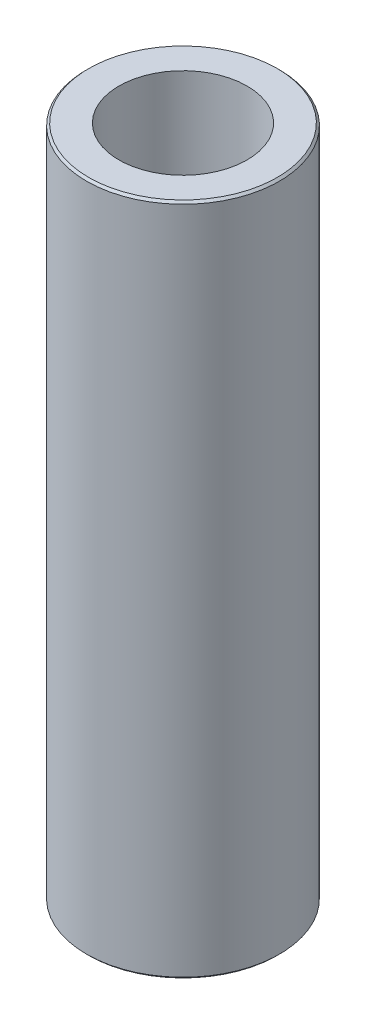
ISO-10303-21;
HEADER;
FILE_DESCRIPTION(('STEP AP214'),'2;1');
FILE_NAME('part.step','',(''),(''),'','','');
FILE_SCHEMA(('AUTOMOTIVE_DESIGN { 1 0 10303 214 1 1 1 1 }'));
ENDSEC;
DATA;
#1=APPLICATION_CONTEXT('core data for automotive mechanical design processes');
#2=APPLICATION_PROTOCOL_DEFINITION('international standard','automotive_design',2000,#1);
#3=PRODUCT_CONTEXT('',#1,'mechanical');
#4=PRODUCT('Part','Part','',(#3));
#5=PRODUCT_RELATED_PRODUCT_CATEGORY('part','',(#4));
#6=PRODUCT_DEFINITION_FORMATION('','',#4);
#7=PRODUCT_DEFINITION_CONTEXT('part definition',#1,'design');
#8=PRODUCT_DEFINITION('design','',#6,#7);
#9=PRODUCT_DEFINITION_SHAPE('','',#8);
#10=(LENGTH_UNIT() NAMED_UNIT(*) SI_UNIT(.MILLI.,.METRE.));
#11=(NAMED_UNIT(*) PLANE_ANGLE_UNIT() SI_UNIT($,.RADIAN.));
#12=(NAMED_UNIT(*) SI_UNIT($,.STERADIAN.) SOLID_ANGLE_UNIT());
#13=UNCERTAINTY_MEASURE_WITH_UNIT(LENGTH_MEASURE(1.E-05),#10,'distance_accuracy_value','');
#14=(GEOMETRIC_REPRESENTATION_CONTEXT(3) GLOBAL_UNCERTAINTY_ASSIGNED_CONTEXT((#13)) GLOBAL_UNIT_ASSIGNED_CONTEXT((#10,
#11,#12)) REPRESENTATION_CONTEXT('',''));
#15=CARTESIAN_POINT('',(0.,0.,0.));
#16=DIRECTION('',(0.,0.,1.));
#17=DIRECTION('',(1.,0.,0.));
#18=AXIS2_PLACEMENT_3D('',#15,#16,#17);
#19=CARTESIAN_POINT('',(0.,314.226367638641,0.));
#20=DIRECTION('',(0.,-1.,0.));
#21=DIRECTION('',(0.,0.,-1.));
#22=AXIS2_PLACEMENT_3D('',#19,#20,#21);
#23=CYLINDRICAL_SURFACE('',#22,45.);
#24=CARTESIAN_POINT('',(0.,313.215439004012,0.));
#25=DIRECTION('',(0.,1.,0.));
#26=DIRECTION('',(0.,0.,1.));
#27=AXIS2_PLACEMENT_3D('',#24,#25,#26);
#28=CIRCLE('',#27,45.);
#29=CARTESIAN_POINT('',(0.,313.215439004012,-45.));
#30=VERTEX_POINT('',#29);
#31=EDGE_CURVE('E50',#30,#30,#28,.F.);
#32=CARTESIAN_POINT('',(0.,1.01092863462909,0.));
#33=DIRECTION('',(0.,1.,0.));
#34=DIRECTION('',(0.,0.,1.));
#35=AXIS2_PLACEMENT_3D('',#32,#33,#34);
#36=CIRCLE('',#35,45.);
#37=CARTESIAN_POINT('',(0.,1.01092863462909,-45.));
#38=VERTEX_POINT('',#37);
#39=EDGE_CURVE('E51',#38,#38,#36,.T.);
#40=CARTESIAN_POINT('',(0.,313.215439004012,-45.));
#41=CARTESIAN_POINT('',(0.,309.963308687664,-45.));
#42=CARTESIAN_POINT('',(0.,306.711178371316,-45.));
#43=CARTESIAN_POINT('',(0.,300.206917738621,-45.));
#44=CARTESIAN_POINT('',(0.,296.954787422273,-45.));
#45=CARTESIAN_POINT('',(0.,290.450526789578,-45.));
#46=CARTESIAN_POINT('',(0.,287.19839647323,-45.));
#47=CARTESIAN_POINT('',(0.,280.694135840534,-45.));
#48=CARTESIAN_POINT('',(0.,277.442005524187,-45.));
#49=CARTESIAN_POINT('',(0.,270.937744891491,-45.));
#50=CARTESIAN_POINT('',(0.,267.685614575144,-45.));
#51=CARTESIAN_POINT('',(0.,261.181353942448,-45.));
#52=CARTESIAN_POINT('',(0.,257.9292236261,-45.));
#53=CARTESIAN_POINT('',(0.,251.424962993405,-45.));
#54=CARTESIAN_POINT('',(0.,248.172832677057,-45.));
#55=CARTESIAN_POINT('',(0.,241.668572044362,-45.));
#56=CARTESIAN_POINT('',(0.,238.416441728014,-45.));
#57=CARTESIAN_POINT('',(0.,231.912181095318,-45.));
#58=CARTESIAN_POINT('',(0.,228.660050778971,-45.));
#59=CARTESIAN_POINT('',(0.,222.155790146275,-45.));
#60=CARTESIAN_POINT('',(0.,218.903659829927,-45.));
#61=CARTESIAN_POINT('',(0.,212.399399197232,-45.));
#62=CARTESIAN_POINT('',(0.,209.147268880884,-45.));
#63=CARTESIAN_POINT('',(0.,202.643008248189,-45.));
#64=CARTESIAN_POINT('',(0.,199.390877931841,-45.));
#65=CARTESIAN_POINT('',(0.,192.886617299146,-45.));
#66=CARTESIAN_POINT('',(0.,189.634486982798,-45.));
#67=CARTESIAN_POINT('',(0.,183.130226350102,-45.));
#68=CARTESIAN_POINT('',(0.,179.878096033755,-45.));
#69=CARTESIAN_POINT('',(0.,173.373835401059,-45.));
#70=CARTESIAN_POINT('',(0.,170.121705084711,-45.));
#71=CARTESIAN_POINT('',(0.,163.617444452016,-45.));
#72=CARTESIAN_POINT('',(0.,160.365314135668,-45.));
#73=CARTESIAN_POINT('',(0.,153.861053502973,-45.));
#74=CARTESIAN_POINT('',(0.,150.608923186625,-45.));
#75=CARTESIAN_POINT('',(0.,144.10466255393,-45.));
#76=CARTESIAN_POINT('',(0.,140.852532237582,-45.));
#77=CARTESIAN_POINT('',(0.,134.348271604886,-45.));
#78=CARTESIAN_POINT('',(0.,131.096141288539,-45.));
#79=CARTESIAN_POINT('',(0.,124.591880655843,-45.));
#80=CARTESIAN_POINT('',(0.,121.339750339495,-45.));
#81=CARTESIAN_POINT('',(0.,114.8354897068,-45.));
#82=CARTESIAN_POINT('',(0.,111.583359390452,-45.));
#83=CARTESIAN_POINT('',(0.,105.079098757757,-45.));
#84=CARTESIAN_POINT('',(0.,101.826968441409,-45.));
#85=CARTESIAN_POINT('',(0.,95.3227078087135,-45.));
#86=CARTESIAN_POINT('',(0.,92.0705774923657,-45.));
#87=CARTESIAN_POINT('',(0.,85.5663168596703,-45.));
#88=CARTESIAN_POINT('',(0.,82.3141865433225,-45.));
#89=CARTESIAN_POINT('',(0.,75.8099259106271,-45.));
#90=CARTESIAN_POINT('',(0.,72.5577955942793,-45.));
#91=CARTESIAN_POINT('',(0.,66.0535349615838,-45.));
#92=CARTESIAN_POINT('',(0.,62.8014046452361,-45.));
#93=CARTESIAN_POINT('',(0.,56.2971440125407,-45.));
#94=CARTESIAN_POINT('',(0.,53.0450136961929,-45.));
#95=CARTESIAN_POINT('',(0.,46.5407530634974,-45.));
#96=CARTESIAN_POINT('',(0.,43.2886227471497,-45.));
#97=CARTESIAN_POINT('',(0.,36.7843621144542,-45.));
#98=CARTESIAN_POINT('',(0.,33.5322317981065,-45.));
#99=CARTESIAN_POINT('',(0.,27.0279711654111,-45.));
#100=CARTESIAN_POINT('',(0.,23.7758408490633,-45.));
#101=CARTESIAN_POINT('',(0.,17.2715802163678,-45.));
#102=CARTESIAN_POINT('',(0.,14.0194499000201,-45.));
#103=CARTESIAN_POINT('',(0.,7.51518926732459,-45.));
#104=CARTESIAN_POINT('',(0.,4.26305895097684,-45.));
#105=CARTESIAN_POINT('',(0.,1.01092863462909,-45.));
#106=B_SPLINE_CURVE_WITH_KNOTS('',3,(#40,#41,#42,#43,#44,#45,#46,#47,#48,#49,#50,#51,#52,#53,
#54,#55,#56,#57,#58,#59,#60,#61,#62,#63,#64,#65,#66,#67,#68,#69,#70,#71,#72,#73,#74,#75,#76,#77,
#78,#79,#80,#81,#82,#83,#84,#85,#86,#87,#88,#89,#90,#91,#92,#93,#94,#95,#96,#97,#98,#99,#100,
#101,#102,#103,#104,#105),.UNSPECIFIED.,.F.,.F.,(4,2,2,2,2,2,2,2,2,2,2,2,2,2,2,2,2,2,2,2,2,2,2,
2,2,2,2,2,2,2,2,2,4),(0.,9.75639094904324,19.5127818980865,29.2691728471297,39.0255637961729,
48.7819547452161,58.5383456942593,68.2947366433025,78.0511275923457,87.8075185413889,
97.5639094904321,107.320300439475,117.076691388519,126.833082337562,136.589473286605,
146.345864235648,156.102255184691,165.858646133735,175.615037082778,185.371428031821,
195.127818980864,204.884209929907,214.640600878951,224.396991827994,234.153382777037,
243.90977372608,253.666164675123,263.422555624167,273.17894657321,282.935337522253,
292.691728471296,302.44811942034,312.204510369383),.UNSPECIFIED.);
#107=EDGE_CURVE('BSEAM39',#30,#38,#106,.T.);
#108=ORIENTED_EDGE('',*,*,#31,.T.);
#109=ORIENTED_EDGE('',*,*,#39,.T.);
#110=ORIENTED_EDGE('',*,*,#107,.T.);
#111=ORIENTED_EDGE('',*,*,#107,.F.);
#112=EDGE_LOOP('',(#108,#110,#109,#111));
#113=FACE_BOUND('',#112,.T.);
#114=ADVANCED_FACE('F39',(#113),#23,.T.);
#115=CARTESIAN_POINT('',(0.,314.226367638641,0.));
#116=DIRECTION('',(0.,1.,0.));
#117=DIRECTION('',(0.,0.,1.));
#118=AXIS2_PLACEMENT_3D('',#115,#116,#117);
#119=PLANE('',#118);
#120=CARTESIAN_POINT('',(0.,314.226367638641,0.));
#121=DIRECTION('',(0.,1.,0.));
#122=DIRECTION('',(0.,0.,1.));
#123=AXIS2_PLACEMENT_3D('',#120,#121,#122);
#124=CIRCLE('',#123,43.9890713653713);
#125=CARTESIAN_POINT('',(0.,314.226367638641,43.9890713653713));
#126=VERTEX_POINT('',#125);
#127=EDGE_CURVE('E54',#126,#126,#124,.T.);
#128=ORIENTED_EDGE('',*,*,#127,.T.);
#129=EDGE_LOOP('',(#128));
#130=FACE_BOUND('',#129,.T.);
#131=CARTESIAN_POINT('',(0.,314.226367638641,0.));
#132=DIRECTION('',(0.,1.,0.));
#133=DIRECTION('',(0.,0.,1.));
#134=AXIS2_PLACEMENT_3D('',#131,#132,#133);
#135=CIRCLE('',#134,29.884970275184);
#136=CARTESIAN_POINT('',(0.,314.226367638641,-29.884970275184));
#137=VERTEX_POINT('',#136);
#138=EDGE_CURVE('E58',#137,#137,#135,.T.);
#139=ORIENTED_EDGE('',*,*,#138,.F.);
#140=EDGE_LOOP('',(#139));
#141=FACE_BOUND('',#140,.T.);
#142=ADVANCED_FACE('F69',(#130,#141),#119,.T.);
#143=CARTESIAN_POINT('',(0.,0.,0.));
#144=DIRECTION('',(0.,1.,0.));
#145=DIRECTION('',(0.,0.,1.));
#146=AXIS2_PLACEMENT_3D('',#143,#144,#145);
#147=PLANE('',#146);
#148=CARTESIAN_POINT('',(0.,0.,0.));
#149=DIRECTION('',(0.,1.,0.));
#150=DIRECTION('',(0.,0.,1.));
#151=AXIS2_PLACEMENT_3D('',#148,#149,#150);
#152=CIRCLE('',#151,43.9890713653709);
#153=CARTESIAN_POINT('',(0.,0.,43.9890713653709));
#154=VERTEX_POINT('',#153);
#155=EDGE_CURVE('E10',#154,#154,#152,.F.);
#156=ORIENTED_EDGE('',*,*,#155,.T.);
#157=EDGE_LOOP('',(#156));
#158=FACE_BOUND('',#157,.T.);
#159=CARTESIAN_POINT('',(0.,0.,0.));
#160=DIRECTION('',(0.,1.,0.));
#161=DIRECTION('',(0.,0.,1.));
#162=AXIS2_PLACEMENT_3D('',#159,#160,#161);
#163=CIRCLE('',#162,29.884970275184);
#164=CARTESIAN_POINT('',(0.,0.,-29.884970275184));
#165=VERTEX_POINT('',#164);
#166=EDGE_CURVE('E63',#165,#165,#163,.T.);
#167=ORIENTED_EDGE('',*,*,#166,.T.);
#168=EDGE_LOOP('',(#167));
#169=FACE_BOUND('',#168,.T.);
#170=ADVANCED_FACE('F75',(#158,#169),#147,.F.);
#171=CARTESIAN_POINT('',(0.,314.226367638641,0.));
#172=DIRECTION('',(0.,-1.,0.));
#173=DIRECTION('',(0.,0.,-1.));
#174=AXIS2_PLACEMENT_3D('',#171,#172,#173);
#175=CYLINDRICAL_SURFACE('',#174,29.884970275184);
#176=CARTESIAN_POINT('',(0.,314.226367638641,-29.884970275184));
#177=CARTESIAN_POINT('',(0.,310.953176309071,-29.884970275184));
#178=CARTESIAN_POINT('',(0.,307.679984979502,-29.884970275184));
#179=CARTESIAN_POINT('',(0.,301.133602320364,-29.884970275184));
#180=CARTESIAN_POINT('',(0.,297.860410990795,-29.884970275184));
#181=CARTESIAN_POINT('',(0.,291.314028331656,-29.884970275184));
#182=CARTESIAN_POINT('',(0.,288.040837002087,-29.884970275184));
#183=CARTESIAN_POINT('',(0.,281.494454342949,-29.884970275184));
#184=CARTESIAN_POINT('',(0.,278.22126301338,-29.884970275184));
#185=CARTESIAN_POINT('',(0.,271.674880354241,-29.884970275184));
#186=CARTESIAN_POINT('',(0.,268.401689024672,-29.884970275184));
#187=CARTESIAN_POINT('',(0.,261.855306365534,-29.884970275184));
#188=CARTESIAN_POINT('',(0.,258.582115035965,-29.884970275184));
#189=CARTESIAN_POINT('',(0.,252.035732376826,-29.884970275184));
#190=CARTESIAN_POINT('',(0.,248.762541047257,-29.884970275184));
#191=CARTESIAN_POINT('',(0.,242.216158388119,-29.884970275184));
#192=CARTESIAN_POINT('',(0.,238.94296705855,-29.884970275184));
#193=CARTESIAN_POINT('',(0.,232.396584399411,-29.884970275184));
#194=CARTESIAN_POINT('',(0.,229.123393069842,-29.884970275184));
#195=CARTESIAN_POINT('',(0.,222.577010410704,-29.884970275184));
#196=CARTESIAN_POINT('',(0.,219.303819081135,-29.884970275184));
#197=CARTESIAN_POINT('',(0.,212.757436421996,-29.884970275184));
#198=CARTESIAN_POINT('',(0.,209.484245092427,-29.884970275184));
#199=CARTESIAN_POINT('',(0.,202.937862433289,-29.884970275184));
#200=CARTESIAN_POINT('',(0.,199.66467110372,-29.884970275184));
#201=CARTESIAN_POINT('',(0.,193.118288444581,-29.884970275184));
#202=CARTESIAN_POINT('',(0.,189.845097115012,-29.884970275184));
#203=CARTESIAN_POINT('',(0.,183.298714455874,-29.884970275184));
#204=CARTESIAN_POINT('',(0.,180.025523126305,-29.884970275184));
#205=CARTESIAN_POINT('',(0.,173.479140467166,-29.884970275184));
#206=CARTESIAN_POINT('',(0.,170.205949137597,-29.884970275184));
#207=CARTESIAN_POINT('',(0.,163.659566478459,-29.884970275184));
#208=CARTESIAN_POINT('',(0.,160.386375148889,-29.884970275184));
#209=CARTESIAN_POINT('',(0.,153.839992489751,-29.884970275184));
#210=CARTESIAN_POINT('',(0.,150.566801160182,-29.884970275184));
#211=CARTESIAN_POINT('',(0.,144.020418501044,-29.884970275184));
#212=CARTESIAN_POINT('',(0.,140.747227171474,-29.884970275184));
#213=CARTESIAN_POINT('',(0.,134.200844512336,-29.884970275184));
#214=CARTESIAN_POINT('',(0.,130.927653182767,-29.884970275184));
#215=CARTESIAN_POINT('',(0.,124.381270523629,-29.884970275184));
#216=CARTESIAN_POINT('',(0.,121.108079194059,-29.884970275184));
#217=CARTESIAN_POINT('',(0.,114.561696534921,-29.884970275184));
#218=CARTESIAN_POINT('',(0.,111.288505205352,-29.884970275184));
#219=CARTESIAN_POINT('',(0.,104.742122546214,-29.884970275184));
#220=CARTESIAN_POINT('',(0.,101.468931216644,-29.884970275184));
#221=CARTESIAN_POINT('',(0.,94.922548557506,-29.884970275184));
#222=CARTESIAN_POINT('',(0.,91.6493572279368,-29.884970275184));
#223=CARTESIAN_POINT('',(0.,85.1029745687985,-29.884970275184));
#224=CARTESIAN_POINT('',(0.,81.8297832392293,-29.884970275184));
#225=CARTESIAN_POINT('',(0.,75.283400580091,-29.884970275184));
#226=CARTESIAN_POINT('',(0.,72.0102092505218,-29.884970275184));
#227=CARTESIAN_POINT('',(0.,65.4638265913834,-29.884970275184));
#228=CARTESIAN_POINT('',(0.,62.1906352618143,-29.884970275184));
#229=CARTESIAN_POINT('',(0.,55.6442526026759,-29.884970275184));
#230=CARTESIAN_POINT('',(0.,52.3710612731067,-29.884970275184));
#231=CARTESIAN_POINT('',(0.,45.8246786139684,-29.884970275184));
#232=CARTESIAN_POINT('',(0.,42.5514872843992,-29.884970275184));
#233=CARTESIAN_POINT('',(0.,36.0051046252609,-29.884970275184));
#234=CARTESIAN_POINT('',(0.,32.7319132956917,-29.884970275184));
#235=CARTESIAN_POINT('',(0.,26.1855306365534,-29.884970275184));
#236=CARTESIAN_POINT('',(0.,22.9123393069842,-29.884970275184));
#237=CARTESIAN_POINT('',(0.,16.3659566478458,-29.884970275184));
#238=CARTESIAN_POINT('',(0.,13.0927653182767,-29.884970275184));
#239=CARTESIAN_POINT('',(0.,6.5463826591383,-29.884970275184));
#240=CARTESIAN_POINT('',(0.,3.27319132956912,-29.884970275184));
#241=CARTESIAN_POINT('',(0.,0.,-29.884970275184));
#242=B_SPLINE_CURVE_WITH_KNOTS('',3,(#176,#177,#178,#179,#180,#181,#182,#183,#184,#185,#186,
#187,#188,#189,#190,#191,#192,#193,#194,#195,#196,#197,#198,#199,#200,#201,#202,#203,#204,#205,
#206,#207,#208,#209,#210,#211,#212,#213,#214,#215,#216,#217,#218,#219,#220,#221,#222,#223,#224,
#225,#226,#227,#228,#229,#230,#231,#232,#233,#234,#235,#236,#237,#238,#239,#240,#241),
.UNSPECIFIED.,.F.,.F.,(4,2,2,2,2,2,2,2,2,2,2,2,2,2,2,2,2,2,2,2,2,2,2,2,2,2,2,2,2,2,2,2,4),(0.,
9.81957398870748,19.639147977415,29.4587219661225,39.2782959548301,49.0978699435376,
58.9174439322451,68.7370179209526,78.5565919096601,88.3761658983677,98.1957398870752,
108.015313875783,117.83488786449,127.654461853198,137.474035841905,147.293609830613,
157.11318381932,166.932757808028,176.752331796735,186.571905785443,196.39147977415,
206.211053762858,216.030627751565,225.850201740273,235.66977572898,245.489349717688,
255.308923706396,265.128497695103,274.948071683811,284.767645672518,294.587219661226,
304.406793649933,314.226367638641),.UNSPECIFIED.);
#243=EDGE_CURVE('BSEAM70',#137,#165,#242,.T.);
#244=ORIENTED_EDGE('',*,*,#138,.T.);
#245=ORIENTED_EDGE('',*,*,#166,.F.);
#246=ORIENTED_EDGE('',*,*,#243,.T.);
#247=ORIENTED_EDGE('',*,*,#243,.F.);
#248=EDGE_LOOP('',(#244,#246,#245,#247));
#249=FACE_BOUND('',#248,.T.);
#250=ADVANCED_FACE('F70',(#249),#175,.F.);
#251=CARTESIAN_POINT('',(0.,314.226367638641,0.));
#252=DIRECTION('',(0.,-1.,0.));
#253=DIRECTION('',(0.,0.,-1.));
#254=AXIS2_PLACEMENT_3D('',#251,#252,#253);
#255=CONICAL_SURFACE('',#254,43.9890713653713,0.785398163397424);
#256=ORIENTED_EDGE('',*,*,#31,.F.);
#257=EDGE_LOOP('',(#256));
#258=FACE_BOUND('',#257,.T.);
#259=ORIENTED_EDGE('',*,*,#127,.F.);
#260=EDGE_LOOP('',(#259));
#261=FACE_BOUND('',#260,.T.);
#262=ADVANCED_FACE('F81',(#258,#261),#255,.T.);
#263=CARTESIAN_POINT('',(0.,1.01092863462909,0.));
#264=DIRECTION('',(0.,1.,0.));
#265=DIRECTION('',(0.,0.,1.));
#266=AXIS2_PLACEMENT_3D('',#263,#264,#265);
#267=CONICAL_SURFACE('',#266,45.,0.785398163397462);
#268=ORIENTED_EDGE('',*,*,#155,.F.);
#269=EDGE_LOOP('',(#268));
#270=FACE_BOUND('',#269,.T.);
#271=ORIENTED_EDGE('',*,*,#39,.F.);
#272=EDGE_LOOP('',(#271));
#273=FACE_BOUND('',#272,.T.);
#274=ADVANCED_FACE('F45',(#270,#273),#267,.T.);
#275=CLOSED_SHELL('',(#114,#142,#170,#250,#262,#274));
#276=MANIFOLD_SOLID_BREP('B2',#275);
#277=ADVANCED_BREP_SHAPE_REPRESENTATION('',(#18,#276),#14);
#278=SHAPE_DEFINITION_REPRESENTATION(#9,#277);
ENDSEC;
END-ISO-10303-21;
